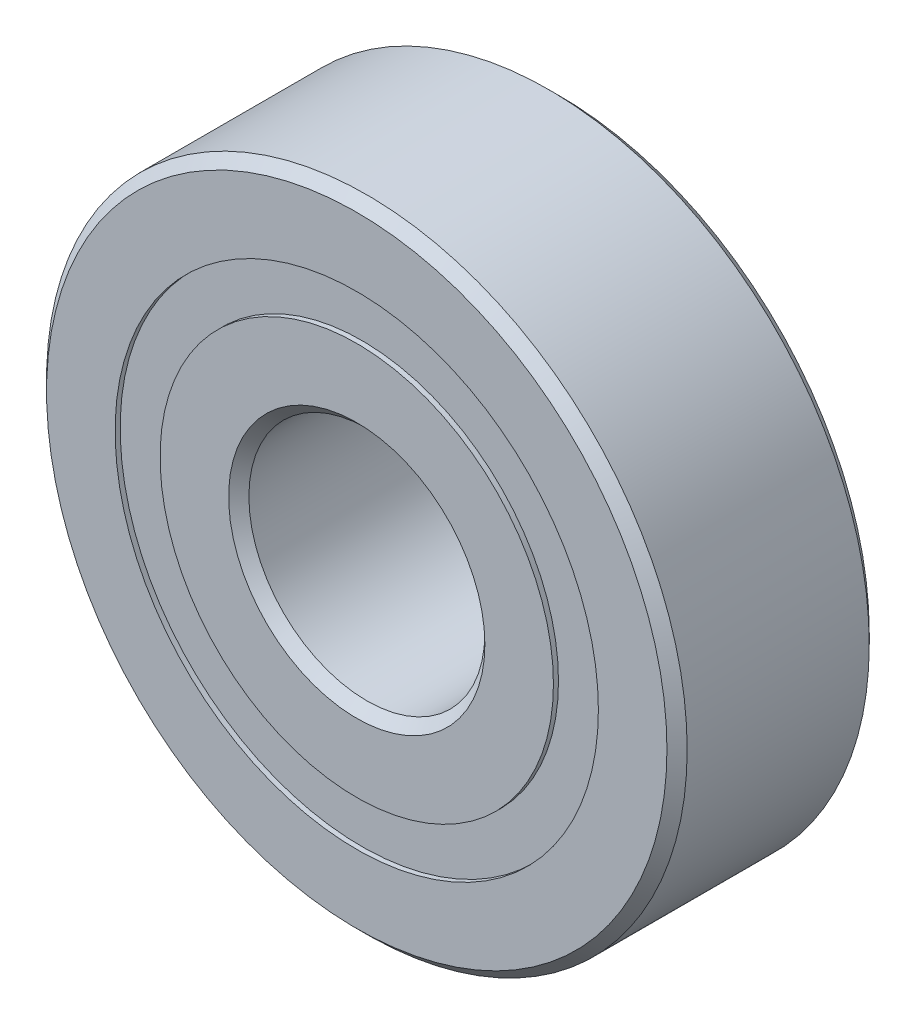
ISO-10303-21;
HEADER;
FILE_DESCRIPTION(('STEP AP214'),'2;1');
FILE_NAME('part.step','',(''),(''),'','','');
FILE_SCHEMA(('AUTOMOTIVE_DESIGN { 1 0 10303 214 1 1 1 1 }'));
ENDSEC;
DATA;
#1=APPLICATION_CONTEXT('core data for automotive mechanical design processes');
#2=APPLICATION_PROTOCOL_DEFINITION('international standard','automotive_design',2000,#1);
#3=PRODUCT_CONTEXT('',#1,'mechanical');
#4=PRODUCT('Part','Part','',(#3));
#5=PRODUCT_RELATED_PRODUCT_CATEGORY('part','',(#4));
#6=PRODUCT_DEFINITION_FORMATION('','',#4);
#7=PRODUCT_DEFINITION_CONTEXT('part definition',#1,'design');
#8=PRODUCT_DEFINITION('design','',#6,#7);
#9=PRODUCT_DEFINITION_SHAPE('','',#8);
#10=(LENGTH_UNIT() NAMED_UNIT(*) SI_UNIT(.MILLI.,.METRE.));
#11=(NAMED_UNIT(*) PLANE_ANGLE_UNIT() SI_UNIT($,.RADIAN.));
#12=(NAMED_UNIT(*) SI_UNIT($,.STERADIAN.) SOLID_ANGLE_UNIT());
#13=UNCERTAINTY_MEASURE_WITH_UNIT(LENGTH_MEASURE(1.E-05),#10,'distance_accuracy_value','');
#14=(GEOMETRIC_REPRESENTATION_CONTEXT(3) GLOBAL_UNCERTAINTY_ASSIGNED_CONTEXT((#13)) GLOBAL_UNIT_ASSIGNED_CONTEXT((#10,
#11,#12)) REPRESENTATION_CONTEXT('',''));
#15=CARTESIAN_POINT('',(0.,0.,0.));
#16=DIRECTION('',(0.,0.,1.));
#17=DIRECTION('',(1.,0.,0.));
#18=AXIS2_PLACEMENT_3D('',#15,#16,#17);
#19=CARTESIAN_POINT('',(0.,7.16666666666667,-1.49071198499986));
#20=DIRECTION('',(0.,0.,-1.));
#21=DIRECTION('',(-1.,0.,0.));
#22=AXIS2_PLACEMENT_3D('',#19,#20,#21);
#23=PLANE('',#22);
#24=CARTESIAN_POINT('',(0.,0.,-1.49071198499986));
#25=DIRECTION('',(0.,0.,1.));
#26=DIRECTION('',(1.,0.,0.));
#27=AXIS2_PLACEMENT_3D('',#24,#25,#26);
#28=CIRCLE('',#27,5.83333333333334);
#29=CARTESIAN_POINT('',(5.83333333333334,0.,-1.49071198499986));
#30=VERTEX_POINT('',#29);
#31=EDGE_CURVE('E11',#30,#30,#28,.T.);
#32=ORIENTED_EDGE('',*,*,#31,.F.);
#33=EDGE_LOOP('',(#32));
#34=FACE_BOUND('',#33,.T.);
#35=CARTESIAN_POINT('',(0.,0.,-1.49071198499986));
#36=DIRECTION('',(0.,0.,1.));
#37=DIRECTION('',(1.,0.,0.));
#38=AXIS2_PLACEMENT_3D('',#35,#36,#37);
#39=CIRCLE('',#38,7.16666666666667);
#40=CARTESIAN_POINT('',(7.16666666666667,0.,-1.49071198499986));
#41=VERTEX_POINT('',#40);
#42=EDGE_CURVE('E55',#41,#41,#39,.T.);
#43=ORIENTED_EDGE('',*,*,#42,.T.);
#44=EDGE_LOOP('',(#43));
#45=FACE_BOUND('',#44,.T.);
#46=ADVANCED_FACE('F41',(#34,#45),#23,.F.);
#47=CARTESIAN_POINT('',(0.,0.,3.));
#48=DIRECTION('',(0.,0.,1.));
#49=DIRECTION('',(1.,0.,0.));
#50=AXIS2_PLACEMENT_3D('',#47,#48,#49);
#51=CYLINDRICAL_SURFACE('',#50,5.83333333333334);
#52=CARTESIAN_POINT('',(0.,0.,-2.85000000000001));
#53=DIRECTION('',(0.,0.,1.));
#54=DIRECTION('',(1.,0.,0.));
#55=AXIS2_PLACEMENT_3D('',#52,#53,#54);
#56=CIRCLE('',#55,5.83333333333334);
#57=CARTESIAN_POINT('',(5.83333333333334,0.,-2.85000000000001));
#58=VERTEX_POINT('',#57);
#59=EDGE_CURVE('E47',#58,#58,#56,.T.);
#60=ORIENTED_EDGE('',*,*,#59,.F.);
#61=EDGE_LOOP('',(#60));
#62=FACE_BOUND('',#61,.T.);
#63=ORIENTED_EDGE('',*,*,#31,.T.);
#64=EDGE_LOOP('',(#63));
#65=FACE_BOUND('',#64,.T.);
#66=ADVANCED_FACE('F70',(#62,#65),#51,.F.);
#67=CARTESIAN_POINT('',(0.,7.16666666666667,-2.85000000000001));
#68=DIRECTION('',(0.,0.,1.));
#69=DIRECTION('',(1.,0.,0.));
#70=AXIS2_PLACEMENT_3D('',#67,#68,#69);
#71=PLANE('',#70);
#72=CARTESIAN_POINT('',(0.,0.,-2.85000000000001));
#73=DIRECTION('',(0.,0.,1.));
#74=DIRECTION('',(1.,0.,0.));
#75=AXIS2_PLACEMENT_3D('',#72,#73,#74);
#76=CIRCLE('',#75,7.16666666666667);
#77=CARTESIAN_POINT('',(7.16666666666667,0.,-2.85000000000001));
#78=VERTEX_POINT('',#77);
#79=EDGE_CURVE('E51',#78,#78,#76,.T.);
#80=ORIENTED_EDGE('',*,*,#79,.F.);
#81=EDGE_LOOP('',(#80));
#82=FACE_BOUND('',#81,.T.);
#83=ORIENTED_EDGE('',*,*,#59,.T.);
#84=EDGE_LOOP('',(#83));
#85=FACE_BOUND('',#84,.T.);
#86=ADVANCED_FACE('F65',(#82,#85),#71,.F.);
#87=CARTESIAN_POINT('',(0.,0.,3.));
#88=DIRECTION('',(0.,0.,1.));
#89=DIRECTION('',(1.,0.,0.));
#90=AXIS2_PLACEMENT_3D('',#87,#88,#89);
#91=CYLINDRICAL_SURFACE('',#90,7.16666666666667);
#92=ORIENTED_EDGE('',*,*,#42,.F.);
#93=EDGE_LOOP('',(#92));
#94=FACE_BOUND('',#93,.T.);
#95=ORIENTED_EDGE('',*,*,#79,.T.);
#96=EDGE_LOOP('',(#95));
#97=FACE_BOUND('',#96,.T.);
#98=ADVANCED_FACE('F62',(#94,#97),#91,.T.);
#99=CLOSED_SHELL('',(#46,#66,#86,#98));
#100=MANIFOLD_SOLID_BREP('B2',#99);
#101=CARTESIAN_POINT('',(0.,7.16666666666667,2.85));
#102=DIRECTION('',(0.,0.,-1.));
#103=DIRECTION('',(-1.,0.,0.));
#104=AXIS2_PLACEMENT_3D('',#101,#102,#103);
#105=PLANE('',#104);
#106=CARTESIAN_POINT('',(0.,0.,2.85));
#107=DIRECTION('',(0.,0.,1.));
#108=DIRECTION('',(1.,0.,0.));
#109=AXIS2_PLACEMENT_3D('',#106,#107,#108);
#110=CIRCLE('',#109,5.83333333333334);
#111=CARTESIAN_POINT('',(5.83333333333334,0.,2.85));
#112=VERTEX_POINT('',#111);
#113=EDGE_CURVE('E40',#112,#112,#110,.T.);
#114=ORIENTED_EDGE('',*,*,#113,.F.);
#115=EDGE_LOOP('',(#114));
#116=FACE_BOUND('',#115,.T.);
#117=CARTESIAN_POINT('',(0.,0.,2.85));
#118=DIRECTION('',(0.,0.,1.));
#119=DIRECTION('',(1.,0.,0.));
#120=AXIS2_PLACEMENT_3D('',#117,#118,#119);
#121=CIRCLE('',#120,7.16666666666667);
#122=CARTESIAN_POINT('',(7.16666666666667,0.,2.85));
#123=VERTEX_POINT('',#122);
#124=EDGE_CURVE('E122',#123,#123,#121,.T.);
#125=ORIENTED_EDGE('',*,*,#124,.T.);
#126=EDGE_LOOP('',(#125));
#127=FACE_BOUND('',#126,.T.);
#128=ADVANCED_FACE('F108',(#116,#127),#105,.F.);
#129=CARTESIAN_POINT('',(0.,0.,3.));
#130=DIRECTION('',(0.,0.,1.));
#131=DIRECTION('',(1.,0.,0.));
#132=AXIS2_PLACEMENT_3D('',#129,#130,#131);
#133=CYLINDRICAL_SURFACE('',#132,5.83333333333334);
#134=CARTESIAN_POINT('',(0.,0.,1.49071198499985));
#135=DIRECTION('',(0.,0.,1.));
#136=DIRECTION('',(1.,0.,0.));
#137=AXIS2_PLACEMENT_3D('',#134,#135,#136);
#138=CIRCLE('',#137,5.83333333333334);
#139=CARTESIAN_POINT('',(5.83333333333334,0.,1.49071198499985));
#140=VERTEX_POINT('',#139);
#141=EDGE_CURVE('E114',#140,#140,#138,.T.);
#142=ORIENTED_EDGE('',*,*,#141,.F.);
#143=EDGE_LOOP('',(#142));
#144=FACE_BOUND('',#143,.T.);
#145=ORIENTED_EDGE('',*,*,#113,.T.);
#146=EDGE_LOOP('',(#145));
#147=FACE_BOUND('',#146,.T.);
#148=ADVANCED_FACE('F137',(#144,#147),#133,.F.);
#149=CARTESIAN_POINT('',(0.,7.16666666666667,1.49071198499985));
#150=DIRECTION('',(0.,0.,1.));
#151=DIRECTION('',(1.,0.,0.));
#152=AXIS2_PLACEMENT_3D('',#149,#150,#151);
#153=PLANE('',#152);
#154=CARTESIAN_POINT('',(0.,0.,1.49071198499985));
#155=DIRECTION('',(0.,0.,1.));
#156=DIRECTION('',(1.,0.,0.));
#157=AXIS2_PLACEMENT_3D('',#154,#155,#156);
#158=CIRCLE('',#157,7.16666666666667);
#159=CARTESIAN_POINT('',(7.16666666666667,0.,1.49071198499985));
#160=VERTEX_POINT('',#159);
#161=EDGE_CURVE('E118',#160,#160,#158,.T.);
#162=ORIENTED_EDGE('',*,*,#161,.F.);
#163=EDGE_LOOP('',(#162));
#164=FACE_BOUND('',#163,.T.);
#165=ORIENTED_EDGE('',*,*,#141,.T.);
#166=EDGE_LOOP('',(#165));
#167=FACE_BOUND('',#166,.T.);
#168=ADVANCED_FACE('F132',(#164,#167),#153,.F.);
#169=CARTESIAN_POINT('',(0.,0.,3.));
#170=DIRECTION('',(0.,0.,1.));
#171=DIRECTION('',(1.,0.,0.));
#172=AXIS2_PLACEMENT_3D('',#169,#170,#171);
#173=CYLINDRICAL_SURFACE('',#172,7.16666666666667);
#174=ORIENTED_EDGE('',*,*,#124,.F.);
#175=EDGE_LOOP('',(#174));
#176=FACE_BOUND('',#175,.T.);
#177=ORIENTED_EDGE('',*,*,#161,.T.);
#178=EDGE_LOOP('',(#177));
#179=FACE_BOUND('',#178,.T.);
#180=ADVANCED_FACE('F129',(#176,#179),#173,.T.);
#181=CLOSED_SHELL('',(#128,#148,#168,#180));
#182=MANIFOLD_SOLID_BREP('B6',#181);
#183=CARTESIAN_POINT('',(-3.02070061828442,5.7554641667459,0.));
#184=DIRECTION('',(0.,0.,1.));
#185=DIRECTION('',(-0.464723172043757,0.885456025653216,0.));
#186=AXIS2_PLACEMENT_3D('',#183,#184,#185);
#187=SPHERICAL_SURFACE('',#186,1.49071198499985);
#188=CARTESIAN_POINT('',(-3.02070061828442,5.7554641667459,1.49071198499985));
#189=VERTEX_POINT('',#188);
#190=VERTEX_LOOP('',#189);
#191=FACE_BOUND('',#190,.T.);
#192=ADVANCED_FACE('F175',(#191),#187,.T.);
#193=CLOSED_SHELL('',(#192));
#194=MANIFOLD_SOLID_BREP('B35',#193);
#195=CARTESIAN_POINT('',(-5.34939512830872,3.69242085375258,0.));
#196=DIRECTION('',(0.,0.,1.));
#197=DIRECTION('',(-0.822983865893649,0.568064746731166,0.));
#198=AXIS2_PLACEMENT_3D('',#195,#196,#197);
#199=SPHERICAL_SURFACE('',#198,1.49071198499985);
#200=CARTESIAN_POINT('',(-5.34939512830872,3.69242085375258,1.49071198499985));
#201=VERTEX_POINT('',#200);
#202=VERTEX_LOOP('',#201);
#203=FACE_BOUND('',#202,.T.);
#204=ADVANCED_FACE('F206',(#203),#199,.T.);
#205=CLOSED_SHELL('',(#204));
#206=MANIFOLD_SOLID_BREP('B104',#205);
#207=CARTESIAN_POINT('',(-6.45260768163735,0.78348842165967,0.));
#208=DIRECTION('',(0.,0.,1.));
#209=DIRECTION('',(-0.992708874098053,0.120536680255334,0.));
#210=AXIS2_PLACEMENT_3D('',#207,#208,#209);
#211=SPHERICAL_SURFACE('',#210,1.49071198499985);
#212=CARTESIAN_POINT('',(-6.45260768163735,0.78348842165967,1.49071198499985));
#213=VERTEX_POINT('',#212);
#214=VERTEX_LOOP('',#213);
#215=FACE_BOUND('',#214,.T.);
#216=ADVANCED_FACE('F237',(#215),#211,.T.);
#217=CLOSED_SHELL('',(#216));
#218=MANIFOLD_SOLID_BREP('B171',#217);
#219=CARTESIAN_POINT('',(-6.07760557745522,-2.30493176577642,0.));
#220=DIRECTION('',(0.,0.,1.));
#221=DIRECTION('',(-0.935016242685418,-0.354604887042527,0.));
#222=AXIS2_PLACEMENT_3D('',#219,#220,#221);
#223=SPHERICAL_SURFACE('',#222,1.49071198499985);
#224=CARTESIAN_POINT('',(-6.07760557745522,-2.30493176577642,1.49071198499985));
#225=VERTEX_POINT('',#224);
#226=VERTEX_LOOP('',#225);
#227=FACE_BOUND('',#226,.T.);
#228=ADVANCED_FACE('F268',(#227),#223,.T.);
#229=CLOSED_SHELL('',(#228));
#230=MANIFOLD_SOLID_BREP('B202',#229);
#231=CARTESIAN_POINT('',(-4.31029727856521,-4.86531986311212,0.));
#232=DIRECTION('',(0.,0.,1.));
#233=DIRECTION('',(-0.663122658240802,-0.748510748171095,0.));
#234=AXIS2_PLACEMENT_3D('',#231,#232,#233);
#235=SPHERICAL_SURFACE('',#234,1.49071198499985);
#236=CARTESIAN_POINT('',(-4.31029727856521,-4.86531986311212,1.49071198499985));
#237=VERTEX_POINT('',#236);
#238=VERTEX_LOOP('',#237);
#239=FACE_BOUND('',#238,.T.);
#240=ADVANCED_FACE('F299',(#239),#235,.T.);
#241=CLOSED_SHELL('',(#240));
#242=MANIFOLD_SOLID_BREP('B233',#241);
#243=CARTESIAN_POINT('',(-1.55555181786917,-6.31112181326933,0.));
#244=DIRECTION('',(0.,0.,1.));
#245=DIRECTION('',(-0.239315664287565,-0.97094181742605,0.));
#246=AXIS2_PLACEMENT_3D('',#243,#244,#245);
#247=SPHERICAL_SURFACE('',#246,1.49071198499985);
#248=CARTESIAN_POINT('',(-1.55555181786917,-6.31112181326933,1.49071198499985));
#249=VERTEX_POINT('',#248);
#250=VERTEX_LOOP('',#249);
#251=FACE_BOUND('',#250,.T.);
#252=ADVANCED_FACE('F330',(#251),#247,.T.);
#253=CLOSED_SHELL('',(#252));
#254=MANIFOLD_SOLID_BREP('B264',#253);
#255=CARTESIAN_POINT('',(1.55555181786909,-6.31112181326935,0.));
#256=DIRECTION('',(0.,0.,1.));
#257=DIRECTION('',(0.239315664287552,-0.970941817426054,0.));
#258=AXIS2_PLACEMENT_3D('',#255,#256,#257);
#259=SPHERICAL_SURFACE('',#258,1.49071198499985);
#260=CARTESIAN_POINT('',(1.55555181786909,-6.31112181326935,1.49071198499985));
#261=VERTEX_POINT('',#260);
#262=VERTEX_LOOP('',#261);
#263=FACE_BOUND('',#262,.T.);
#264=ADVANCED_FACE('F361',(#263),#259,.T.);
#265=CLOSED_SHELL('',(#264));
#266=MANIFOLD_SOLID_BREP('B295',#265);
#267=CARTESIAN_POINT('',(4.31029727856514,-4.86531986311218,0.));
#268=DIRECTION('',(0.,0.,1.));
#269=DIRECTION('',(0.663122658240791,-0.748510748171105,0.));
#270=AXIS2_PLACEMENT_3D('',#267,#268,#269);
#271=SPHERICAL_SURFACE('',#270,1.49071198499985);
#272=CARTESIAN_POINT('',(4.31029727856514,-4.86531986311218,1.49071198499985));
#273=VERTEX_POINT('',#272);
#274=VERTEX_LOOP('',#273);
#275=FACE_BOUND('',#274,.T.);
#276=ADVANCED_FACE('F392',(#275),#271,.T.);
#277=CLOSED_SHELL('',(#276));
#278=MANIFOLD_SOLID_BREP('B326',#277);
#279=CARTESIAN_POINT('',(6.07760557745519,-2.30493176577651,0.));
#280=DIRECTION('',(0.,0.,1.));
#281=DIRECTION('',(0.935016242685413,-0.35460488704254,0.));
#282=AXIS2_PLACEMENT_3D('',#279,#280,#281);
#283=SPHERICAL_SURFACE('',#282,1.49071198499985);
#284=CARTESIAN_POINT('',(6.07760557745519,-2.30493176577651,1.49071198499985));
#285=VERTEX_POINT('',#284);
#286=VERTEX_LOOP('',#285);
#287=FACE_BOUND('',#286,.T.);
#288=ADVANCED_FACE('F423',(#287),#283,.T.);
#289=CLOSED_SHELL('',(#288));
#290=MANIFOLD_SOLID_BREP('B357',#289);
#291=CARTESIAN_POINT('',(6.45260768163736,0.78348842165958,0.));
#292=DIRECTION('',(0.,0.,1.));
#293=DIRECTION('',(0.992708874098054,0.12053668025532,0.));
#294=AXIS2_PLACEMENT_3D('',#291,#292,#293);
#295=SPHERICAL_SURFACE('',#294,1.49071198499985);
#296=CARTESIAN_POINT('',(6.45260768163736,0.78348842165958,1.49071198499985));
#297=VERTEX_POINT('',#296);
#298=VERTEX_LOOP('',#297);
#299=FACE_BOUND('',#298,.T.);
#300=ADVANCED_FACE('F454',(#299),#295,.T.);
#301=CLOSED_SHELL('',(#300));
#302=MANIFOLD_SOLID_BREP('B388',#301);
#303=CARTESIAN_POINT('',(5.34939512830878,3.6924208537525,0.));
#304=DIRECTION('',(0.,0.,1.));
#305=DIRECTION('',(0.822983865893658,0.568064746731154,0.));
#306=AXIS2_PLACEMENT_3D('',#303,#304,#305);
#307=SPHERICAL_SURFACE('',#306,1.49071198499985);
#308=CARTESIAN_POINT('',(5.34939512830878,3.6924208537525,1.49071198499985));
#309=VERTEX_POINT('',#308);
#310=VERTEX_LOOP('',#309);
#311=FACE_BOUND('',#310,.T.);
#312=ADVANCED_FACE('F485',(#311),#307,.T.);
#313=CLOSED_SHELL('',(#312));
#314=MANIFOLD_SOLID_BREP('B419',#313);
#315=CARTESIAN_POINT('',(3.0207006182845,5.75546416674586,0.));
#316=DIRECTION('',(0.,0.,1.));
#317=DIRECTION('',(0.46472317204377,0.885456025653209,0.));
#318=AXIS2_PLACEMENT_3D('',#315,#316,#317);
#319=SPHERICAL_SURFACE('',#318,1.49071198499985);
#320=CARTESIAN_POINT('',(3.0207006182845,5.75546416674586,1.49071198499985));
#321=VERTEX_POINT('',#320);
#322=VERTEX_LOOP('',#321);
#323=FACE_BOUND('',#322,.T.);
#324=ADVANCED_FACE('F516',(#323),#319,.T.);
#325=CLOSED_SHELL('',(#324));
#326=MANIFOLD_SOLID_BREP('B450',#325);
#327=CARTESIAN_POINT('',(0.,6.5,0.));
#328=DIRECTION('',(0.,0.,1.));
#329=DIRECTION('',(0.,1.,0.));
#330=AXIS2_PLACEMENT_3D('',#327,#328,#329);
#331=SPHERICAL_SURFACE('',#330,1.49071198499985);
#332=CARTESIAN_POINT('',(0.,6.5,1.49071198499985));
#333=VERTEX_POINT('',#332);
#334=VERTEX_LOOP('',#333);
#335=FACE_BOUND('',#334,.T.);
#336=ADVANCED_FACE('F549',(#335),#331,.T.);
#337=CLOSED_SHELL('',(#336));
#338=MANIFOLD_SOLID_BREP('B481',#337);
#339=CARTESIAN_POINT('',(0.,5.83333333333334,3.));
#340=DIRECTION('',(0.,0.,-1.));
#341=DIRECTION('',(-1.,0.,0.));
#342=AXIS2_PLACEMENT_3D('',#339,#340,#341);
#343=PLANE('',#342);
#344=CARTESIAN_POINT('',(0.,0.,3.));
#345=DIRECTION('',(0.,0.,1.));
#346=DIRECTION('',(1.,0.,0.));
#347=AXIS2_PLACEMENT_3D('',#344,#345,#346);
#348=CIRCLE('',#347,3.8);
#349=CARTESIAN_POINT('',(3.8,0.,3.));
#350=VERTEX_POINT('',#349);
#351=EDGE_CURVE('E548',#350,#350,#348,.T.);
#352=ORIENTED_EDGE('',*,*,#351,.F.);
#353=EDGE_LOOP('',(#352));
#354=FACE_BOUND('',#353,.T.);
#355=CARTESIAN_POINT('',(0.,0.,3.));
#356=DIRECTION('',(0.,0.,1.));
#357=DIRECTION('',(1.,0.,0.));
#358=AXIS2_PLACEMENT_3D('',#355,#356,#357);
#359=CIRCLE('',#358,5.83333333333334);
#360=CARTESIAN_POINT('',(5.83333333333334,0.,3.));
#361=VERTEX_POINT('',#360);
#362=EDGE_CURVE('E596',#361,#361,#359,.T.);
#363=ORIENTED_EDGE('',*,*,#362,.T.);
#364=EDGE_LOOP('',(#363));
#365=FACE_BOUND('',#364,.T.);
#366=ADVANCED_FACE('F568',(#354,#365),#343,.F.);
#367=CARTESIAN_POINT('',(0.,0.,3.));
#368=DIRECTION('',(0.,0.,1.));
#369=DIRECTION('',(1.,0.,0.));
#370=AXIS2_PLACEMENT_3D('',#367,#368,#369);
#371=CONICAL_SURFACE('',#370,3.8,0.785398163397445);
#372=CARTESIAN_POINT('',(0.,0.,2.7));
#373=DIRECTION('',(0.,0.,1.));
#374=DIRECTION('',(1.,0.,0.));
#375=AXIS2_PLACEMENT_3D('',#372,#373,#374);
#376=CIRCLE('',#375,3.5);
#377=CARTESIAN_POINT('',(3.5,0.,2.7));
#378=VERTEX_POINT('',#377);
#379=EDGE_CURVE('E574',#378,#378,#376,.T.);
#380=ORIENTED_EDGE('',*,*,#379,.F.);
#381=EDGE_LOOP('',(#380));
#382=FACE_BOUND('',#381,.T.);
#383=ORIENTED_EDGE('',*,*,#351,.T.);
#384=EDGE_LOOP('',(#383));
#385=FACE_BOUND('',#384,.T.);
#386=ADVANCED_FACE('F633',(#382,#385),#371,.F.);
#387=CARTESIAN_POINT('',(0.,0.,3.));
#388=DIRECTION('',(0.,0.,1.));
#389=DIRECTION('',(1.,0.,0.));
#390=AXIS2_PLACEMENT_3D('',#387,#388,#389);
#391=CYLINDRICAL_SURFACE('',#390,3.5);
#392=CARTESIAN_POINT('',(0.,0.,-2.7));
#393=DIRECTION('',(0.,0.,1.));
#394=DIRECTION('',(1.,0.,0.));
#395=AXIS2_PLACEMENT_3D('',#392,#393,#394);
#396=CIRCLE('',#395,3.5);
#397=CARTESIAN_POINT('',(3.5,0.,-2.7));
#398=VERTEX_POINT('',#397);
#399=EDGE_CURVE('E578',#398,#398,#396,.T.);
#400=ORIENTED_EDGE('',*,*,#399,.F.);
#401=EDGE_LOOP('',(#400));
#402=FACE_BOUND('',#401,.T.);
#403=ORIENTED_EDGE('',*,*,#379,.T.);
#404=EDGE_LOOP('',(#403));
#405=FACE_BOUND('',#404,.T.);
#406=ADVANCED_FACE('F628',(#402,#405),#391,.F.);
#407=CARTESIAN_POINT('',(0.,0.,-2.7));
#408=DIRECTION('',(0.,0.,-1.));
#409=DIRECTION('',(-1.,0.,0.));
#410=AXIS2_PLACEMENT_3D('',#407,#408,#409);
#411=CONICAL_SURFACE('',#410,3.5,0.785398163397445);
#412=CARTESIAN_POINT('',(0.,0.,-3.));
#413=DIRECTION('',(0.,0.,1.));
#414=DIRECTION('',(1.,0.,0.));
#415=AXIS2_PLACEMENT_3D('',#412,#413,#414);
#416=CIRCLE('',#415,3.8);
#417=CARTESIAN_POINT('',(3.8,0.,-3.));
#418=VERTEX_POINT('',#417);
#419=EDGE_CURVE('E582',#418,#418,#416,.T.);
#420=ORIENTED_EDGE('',*,*,#419,.F.);
#421=EDGE_LOOP('',(#420));
#422=FACE_BOUND('',#421,.T.);
#423=ORIENTED_EDGE('',*,*,#399,.T.);
#424=EDGE_LOOP('',(#423));
#425=FACE_BOUND('',#424,.T.);
#426=ADVANCED_FACE('F622',(#422,#425),#411,.F.);
#427=CARTESIAN_POINT('',(0.,5.83333333333334,-3.00000000000001));
#428=DIRECTION('',(0.,0.,1.));
#429=DIRECTION('',(1.,0.,0.));
#430=AXIS2_PLACEMENT_3D('',#427,#428,#429);
#431=PLANE('',#430);
#432=CARTESIAN_POINT('',(0.,0.,-3.00000000000001));
#433=DIRECTION('',(0.,0.,1.));
#434=DIRECTION('',(1.,0.,0.));
#435=AXIS2_PLACEMENT_3D('',#432,#433,#434);
#436=CIRCLE('',#435,5.83333333333334);
#437=CARTESIAN_POINT('',(5.83333333333334,0.,-3.00000000000001));
#438=VERTEX_POINT('',#437);
#439=EDGE_CURVE('E587',#438,#438,#436,.T.);
#440=ORIENTED_EDGE('',*,*,#439,.F.);
#441=EDGE_LOOP('',(#440));
#442=FACE_BOUND('',#441,.T.);
#443=ORIENTED_EDGE('',*,*,#419,.T.);
#444=EDGE_LOOP('',(#443));
#445=FACE_BOUND('',#444,.T.);
#446=ADVANCED_FACE('F616',(#442,#445),#431,.F.);
#447=CARTESIAN_POINT('',(0.,0.,3.));
#448=DIRECTION('',(0.,0.,1.));
#449=DIRECTION('',(1.,0.,0.));
#450=AXIS2_PLACEMENT_3D('',#447,#448,#449);
#451=CYLINDRICAL_SURFACE('',#450,5.83333333333334);
#452=CARTESIAN_POINT('',(0.,0.,-1.33333333333334));
#453=DIRECTION('',(0.,0.,1.));
#454=DIRECTION('',(1.,0.,0.));
#455=AXIS2_PLACEMENT_3D('',#452,#453,#454);
#456=CIRCLE('',#455,5.83333333333334);
#457=CARTESIAN_POINT('',(5.83333333333334,0.,-1.33333333333334));
#458=VERTEX_POINT('',#457);
#459=EDGE_CURVE('E590',#458,#458,#456,.T.);
#460=ORIENTED_EDGE('',*,*,#459,.F.);
#461=EDGE_LOOP('',(#460));
#462=FACE_BOUND('',#461,.T.);
#463=ORIENTED_EDGE('',*,*,#439,.T.);
#464=EDGE_LOOP('',(#463));
#465=FACE_BOUND('',#464,.T.);
#466=ADVANCED_FACE('F610',(#462,#465),#451,.T.);
#467=CARTESIAN_POINT('',(0.,0.,0.));
#468=DIRECTION('',(0.,0.,1.));
#469=DIRECTION('',(1.,0.,0.));
#470=AXIS2_PLACEMENT_3D('',#467,#468,#469);
#471=TOROIDAL_SURFACE('',#470,6.5,1.49071198499986);
#472=CARTESIAN_POINT('',(0.,0.,1.33333333333333));
#473=DIRECTION('',(0.,0.,1.));
#474=DIRECTION('',(1.,0.,0.));
#475=AXIS2_PLACEMENT_3D('',#472,#473,#474);
#476=CIRCLE('',#475,5.83333333333334);
#477=CARTESIAN_POINT('',(5.83333333333334,0.,1.33333333333333));
#478=VERTEX_POINT('',#477);
#479=EDGE_CURVE('E593',#478,#478,#476,.T.);
#480=ORIENTED_EDGE('',*,*,#479,.F.);
#481=EDGE_LOOP('',(#480));
#482=FACE_BOUND('',#481,.T.);
#483=ORIENTED_EDGE('',*,*,#459,.T.);
#484=EDGE_LOOP('',(#483));
#485=FACE_BOUND('',#484,.T.);
#486=ADVANCED_FACE('F604',(#482,#485),#471,.F.);
#487=CARTESIAN_POINT('',(0.,0.,3.));
#488=DIRECTION('',(0.,0.,1.));
#489=DIRECTION('',(1.,0.,0.));
#490=AXIS2_PLACEMENT_3D('',#487,#488,#489);
#491=CYLINDRICAL_SURFACE('',#490,5.83333333333334);
#492=ORIENTED_EDGE('',*,*,#362,.F.);
#493=EDGE_LOOP('',(#492));
#494=FACE_BOUND('',#493,.T.);
#495=ORIENTED_EDGE('',*,*,#479,.T.);
#496=EDGE_LOOP('',(#495));
#497=FACE_BOUND('',#496,.T.);
#498=ADVANCED_FACE('F601',(#494,#497),#491,.T.);
#499=CLOSED_SHELL('',(#366,#386,#406,#426,#446,#466,#486,#498));
#500=MANIFOLD_SOLID_BREP('B512',#499);
#501=CARTESIAN_POINT('',(0.,0.,2.7));
#502=DIRECTION('',(0.,0.,-1.));
#503=DIRECTION('',(-1.,0.,0.));
#504=AXIS2_PLACEMENT_3D('',#501,#502,#503);
#505=CONICAL_SURFACE('',#504,9.5,0.78539816339745);
#506=CARTESIAN_POINT('',(0.,0.,3.));
#507=DIRECTION('',(0.,0.,1.));
#508=DIRECTION('',(1.,0.,0.));
#509=AXIS2_PLACEMENT_3D('',#506,#507,#508);
#510=CIRCLE('',#509,9.2);
#511=CARTESIAN_POINT('',(9.2,0.,3.));
#512=VERTEX_POINT('',#511);
#513=EDGE_CURVE('E717',#512,#512,#510,.T.);
#514=ORIENTED_EDGE('',*,*,#513,.F.);
#515=EDGE_LOOP('',(#514));
#516=FACE_BOUND('',#515,.T.);
#517=CARTESIAN_POINT('',(0.,0.,2.7));
#518=DIRECTION('',(0.,0.,1.));
#519=DIRECTION('',(1.,0.,0.));
#520=AXIS2_PLACEMENT_3D('',#517,#518,#519);
#521=CIRCLE('',#520,9.5);
#522=CARTESIAN_POINT('',(9.5,0.,2.7));
#523=VERTEX_POINT('',#522);
#524=EDGE_CURVE('E567',#523,#523,#521,.T.);
#525=ORIENTED_EDGE('',*,*,#524,.T.);
#526=EDGE_LOOP('',(#525));
#527=FACE_BOUND('',#526,.T.);
#528=ADVANCED_FACE('F689',(#516,#527),#505,.T.);
#529=CARTESIAN_POINT('',(0.,0.,3.));
#530=DIRECTION('',(0.,0.,1.));
#531=DIRECTION('',(1.,0.,0.));
#532=AXIS2_PLACEMENT_3D('',#529,#530,#531);
#533=CYLINDRICAL_SURFACE('',#532,9.5);
#534=ORIENTED_EDGE('',*,*,#524,.F.);
#535=EDGE_LOOP('',(#534));
#536=FACE_BOUND('',#535,.T.);
#537=CARTESIAN_POINT('',(0.,0.,-2.70000000000001));
#538=DIRECTION('',(0.,0.,1.));
#539=DIRECTION('',(1.,0.,0.));
#540=AXIS2_PLACEMENT_3D('',#537,#538,#539);
#541=CIRCLE('',#540,9.5);
#542=CARTESIAN_POINT('',(9.5,0.,-2.70000000000001));
#543=VERTEX_POINT('',#542);
#544=EDGE_CURVE('E695',#543,#543,#541,.T.);
#545=ORIENTED_EDGE('',*,*,#544,.T.);
#546=EDGE_LOOP('',(#545));
#547=FACE_BOUND('',#546,.T.);
#548=ADVANCED_FACE('F724',(#536,#547),#533,.T.);
#549=CARTESIAN_POINT('',(0.,0.,-3.00000000000001));
#550=DIRECTION('',(0.,0.,1.));
#551=DIRECTION('',(1.,0.,0.));
#552=AXIS2_PLACEMENT_3D('',#549,#550,#551);
#553=CONICAL_SURFACE('',#552,9.2,0.785398163397448);
#554=ORIENTED_EDGE('',*,*,#544,.F.);
#555=EDGE_LOOP('',(#554));
#556=FACE_BOUND('',#555,.T.);
#557=CARTESIAN_POINT('',(0.,0.,-3.00000000000001));
#558=DIRECTION('',(0.,0.,1.));
#559=DIRECTION('',(1.,0.,0.));
#560=AXIS2_PLACEMENT_3D('',#557,#558,#559);
#561=CIRCLE('',#560,9.2);
#562=CARTESIAN_POINT('',(9.2,0.,-3.00000000000001));
#563=VERTEX_POINT('',#562);
#564=EDGE_CURVE('E699',#563,#563,#561,.T.);
#565=ORIENTED_EDGE('',*,*,#564,.T.);
#566=EDGE_LOOP('',(#565));
#567=FACE_BOUND('',#566,.T.);
#568=ADVANCED_FACE('F728',(#556,#567),#553,.T.);
#569=CARTESIAN_POINT('',(0.,9.2,-3.00000000000001));
#570=DIRECTION('',(0.,0.,1.));
#571=DIRECTION('',(1.,0.,0.));
#572=AXIS2_PLACEMENT_3D('',#569,#570,#571);
#573=PLANE('',#572);
#574=ORIENTED_EDGE('',*,*,#564,.F.);
#575=EDGE_LOOP('',(#574));
#576=FACE_BOUND('',#575,.T.);
#577=CARTESIAN_POINT('',(0.,0.,-3.00000000000001));
#578=DIRECTION('',(0.,0.,1.));
#579=DIRECTION('',(1.,0.,0.));
#580=AXIS2_PLACEMENT_3D('',#577,#578,#579);
#581=CIRCLE('',#580,7.16666666666667);
#582=CARTESIAN_POINT('',(7.16666666666667,0.,-3.00000000000001));
#583=VERTEX_POINT('',#582);
#584=EDGE_CURVE('E703',#583,#583,#581,.T.);
#585=ORIENTED_EDGE('',*,*,#584,.T.);
#586=EDGE_LOOP('',(#585));
#587=FACE_BOUND('',#586,.T.);
#588=ADVANCED_FACE('F733',(#576,#587),#573,.F.);
#589=CARTESIAN_POINT('',(0.,0.,3.));
#590=DIRECTION('',(0.,0.,1.));
#591=DIRECTION('',(1.,0.,0.));
#592=AXIS2_PLACEMENT_3D('',#589,#590,#591);
#593=CYLINDRICAL_SURFACE('',#592,7.16666666666667);
#594=ORIENTED_EDGE('',*,*,#584,.F.);
#595=EDGE_LOOP('',(#594));
#596=FACE_BOUND('',#595,.T.);
#597=CARTESIAN_POINT('',(0.,0.,-1.33333333333334));
#598=DIRECTION('',(0.,0.,1.));
#599=DIRECTION('',(1.,0.,0.));
#600=AXIS2_PLACEMENT_3D('',#597,#598,#599);
#601=CIRCLE('',#600,7.16666666666667);
#602=CARTESIAN_POINT('',(7.16666666666667,0.,-1.33333333333334));
#603=VERTEX_POINT('',#602);
#604=EDGE_CURVE('E708',#603,#603,#601,.T.);
#605=ORIENTED_EDGE('',*,*,#604,.T.);
#606=EDGE_LOOP('',(#605));
#607=FACE_BOUND('',#606,.T.);
#608=ADVANCED_FACE('F739',(#596,#607),#593,.F.);
#609=CARTESIAN_POINT('',(0.,0.,0.));
#610=DIRECTION('',(0.,0.,1.));
#611=DIRECTION('',(1.,0.,0.));
#612=AXIS2_PLACEMENT_3D('',#609,#610,#611);
#613=TOROIDAL_SURFACE('',#612,6.5,1.49071198499986);
#614=ORIENTED_EDGE('',*,*,#604,.F.);
#615=EDGE_LOOP('',(#614));
#616=FACE_BOUND('',#615,.T.);
#617=CARTESIAN_POINT('',(0.,0.,1.33333333333333));
#618=DIRECTION('',(0.,0.,1.));
#619=DIRECTION('',(1.,0.,0.));
#620=AXIS2_PLACEMENT_3D('',#617,#618,#619);
#621=CIRCLE('',#620,7.16666666666667);
#622=CARTESIAN_POINT('',(7.16666666666667,0.,1.33333333333333));
#623=VERTEX_POINT('',#622);
#624=EDGE_CURVE('E711',#623,#623,#621,.T.);
#625=ORIENTED_EDGE('',*,*,#624,.T.);
#626=EDGE_LOOP('',(#625));
#627=FACE_BOUND('',#626,.T.);
#628=ADVANCED_FACE('F743',(#616,#627),#613,.F.);
#629=CARTESIAN_POINT('',(0.,0.,3.));
#630=DIRECTION('',(0.,0.,1.));
#631=DIRECTION('',(1.,0.,0.));
#632=AXIS2_PLACEMENT_3D('',#629,#630,#631);
#633=CYLINDRICAL_SURFACE('',#632,7.16666666666667);
#634=ORIENTED_EDGE('',*,*,#624,.F.);
#635=EDGE_LOOP('',(#634));
#636=FACE_BOUND('',#635,.T.);
#637=CARTESIAN_POINT('',(0.,0.,3.));
#638=DIRECTION('',(0.,0.,1.));
#639=DIRECTION('',(1.,0.,0.));
#640=AXIS2_PLACEMENT_3D('',#637,#638,#639);
#641=CIRCLE('',#640,7.16666666666667);
#642=CARTESIAN_POINT('',(7.16666666666667,0.,3.));
#643=VERTEX_POINT('',#642);
#644=EDGE_CURVE('E714',#643,#643,#641,.T.);
#645=ORIENTED_EDGE('',*,*,#644,.T.);
#646=EDGE_LOOP('',(#645));
#647=FACE_BOUND('',#646,.T.);
#648=ADVANCED_FACE('F747',(#636,#647),#633,.F.);
#649=CARTESIAN_POINT('',(0.,9.2,3.));
#650=DIRECTION('',(0.,0.,-1.));
#651=DIRECTION('',(-1.,0.,0.));
#652=AXIS2_PLACEMENT_3D('',#649,#650,#651);
#653=PLANE('',#652);
#654=ORIENTED_EDGE('',*,*,#644,.F.);
#655=EDGE_LOOP('',(#654));
#656=FACE_BOUND('',#655,.T.);
#657=ORIENTED_EDGE('',*,*,#513,.T.);
#658=EDGE_LOOP('',(#657));
#659=FACE_BOUND('',#658,.T.);
#660=ADVANCED_FACE('F721',(#656,#659),#653,.F.);
#661=CLOSED_SHELL('',(#528,#548,#568,#588,#608,#628,#648,#660));
#662=MANIFOLD_SOLID_BREP('B543',#661);
#663=ADVANCED_BREP_SHAPE_REPRESENTATION('',(#18,#100,#182,#194,#206,#218,#230,#242,#254,#266,
#278,#290,#302,#314,#326,#338,#500,#662),#14);
#664=SHAPE_DEFINITION_REPRESENTATION(#9,#663);
ENDSEC;
END-ISO-10303-21;
